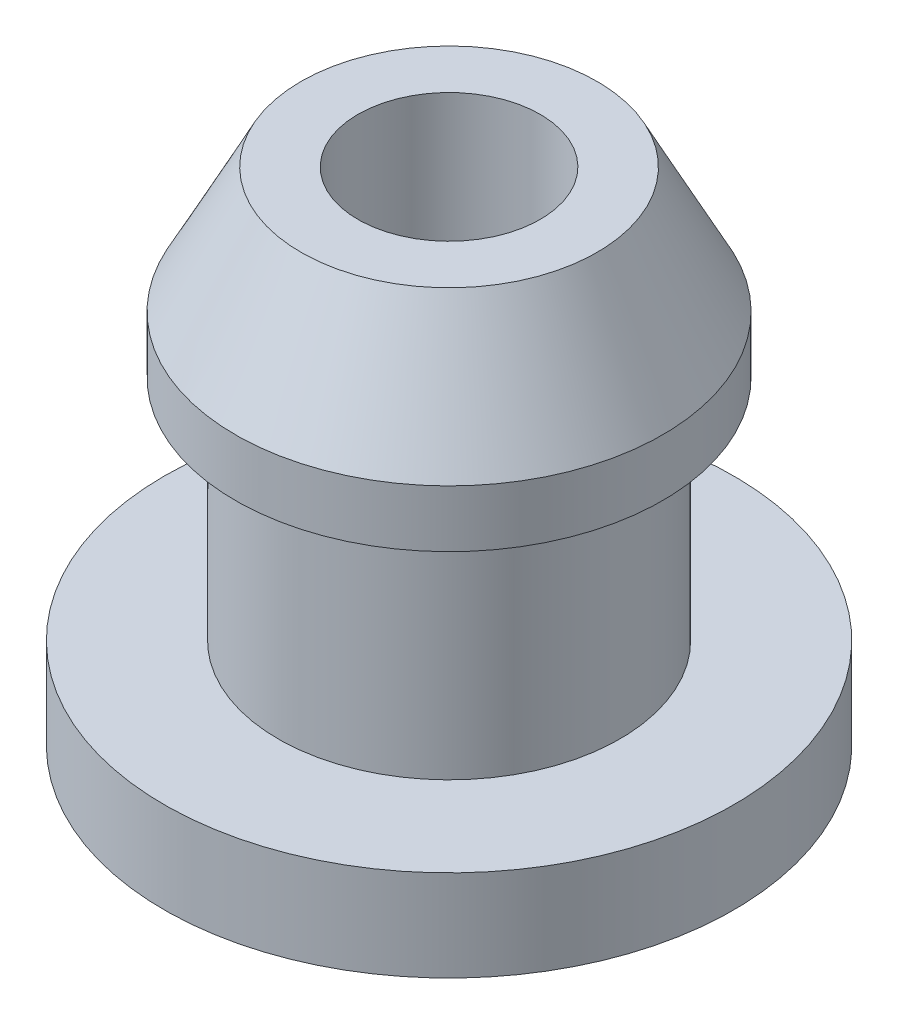
ISO-10303-21;
HEADER;
FILE_DESCRIPTION(('STEP AP214'),'2;1');
FILE_NAME('part.step','',(''),(''),'','','');
FILE_SCHEMA(('AUTOMOTIVE_DESIGN { 1 0 10303 214 1 1 1 1 }'));
ENDSEC;
DATA;
#1=APPLICATION_CONTEXT('core data for automotive mechanical design processes');
#2=APPLICATION_PROTOCOL_DEFINITION('international standard','automotive_design',2000,#1);
#3=PRODUCT_CONTEXT('',#1,'mechanical');
#4=PRODUCT('Part','Part','',(#3));
#5=PRODUCT_RELATED_PRODUCT_CATEGORY('part','',(#4));
#6=PRODUCT_DEFINITION_FORMATION('','',#4);
#7=PRODUCT_DEFINITION_CONTEXT('part definition',#1,'design');
#8=PRODUCT_DEFINITION('design','',#6,#7);
#9=PRODUCT_DEFINITION_SHAPE('','',#8);
#10=(LENGTH_UNIT() NAMED_UNIT(*) SI_UNIT(.MILLI.,.METRE.));
#11=(NAMED_UNIT(*) PLANE_ANGLE_UNIT() SI_UNIT($,.RADIAN.));
#12=(NAMED_UNIT(*) SI_UNIT($,.STERADIAN.) SOLID_ANGLE_UNIT());
#13=UNCERTAINTY_MEASURE_WITH_UNIT(LENGTH_MEASURE(1.E-05),#10,'distance_accuracy_value','');
#14=(GEOMETRIC_REPRESENTATION_CONTEXT(3) GLOBAL_UNCERTAINTY_ASSIGNED_CONTEXT((#13)) GLOBAL_UNIT_ASSIGNED_CONTEXT((#10,
#11,#12)) REPRESENTATION_CONTEXT('',''));
#15=CARTESIAN_POINT('',(0.,0.,0.));
#16=DIRECTION('',(0.,0.,1.));
#17=DIRECTION('',(1.,0.,0.));
#18=AXIS2_PLACEMENT_3D('',#15,#16,#17);
#19=CARTESIAN_POINT('',(0.,-4.4,0.));
#20=DIRECTION('',(0.,1.,0.));
#21=DIRECTION('',(-1.,0.,0.));
#22=AXIS2_PLACEMENT_3D('',#19,#20,#21);
#23=PLANE('',#22);
#24=CARTESIAN_POINT('',(0.,-4.4,0.));
#25=DIRECTION('',(0.,1.,0.));
#26=DIRECTION('',(-1.,0.,0.));
#27=AXIS2_PLACEMENT_3D('',#24,#25,#26);
#28=CIRCLE('',#27,5.);
#29=CARTESIAN_POINT('',(-5.,-4.4,0.));
#30=VERTEX_POINT('',#29);
#31=EDGE_CURVE('E10',#30,#30,#28,.T.);
#32=ORIENTED_EDGE('',*,*,#31,.F.);
#33=EDGE_LOOP('',(#32));
#34=FACE_BOUND('',#33,.T.);
#35=ADVANCED_FACE('F35',(#34),#23,.F.);
#36=CARTESIAN_POINT('',(0.,5.28,0.));
#37=DIRECTION('',(0.,1.,0.));
#38=DIRECTION('',(-1.,0.,0.));
#39=AXIS2_PLACEMENT_3D('',#36,#37,#38);
#40=CYLINDRICAL_SURFACE('',#39,5.);
#41=CARTESIAN_POINT('',(0.,-2.8,0.));
#42=DIRECTION('',(0.,1.,0.));
#43=DIRECTION('',(-1.,0.,0.));
#44=AXIS2_PLACEMENT_3D('',#41,#42,#43);
#45=CIRCLE('',#44,5.);
#46=CARTESIAN_POINT('',(-5.,-2.8,0.));
#47=VERTEX_POINT('',#46);
#48=EDGE_CURVE('E41',#47,#47,#45,.T.);
#49=ORIENTED_EDGE('',*,*,#48,.F.);
#50=EDGE_LOOP('',(#49));
#51=FACE_BOUND('',#50,.T.);
#52=ORIENTED_EDGE('',*,*,#31,.T.);
#53=EDGE_LOOP('',(#52));
#54=FACE_BOUND('',#53,.T.);
#55=ADVANCED_FACE('F110',(#51,#54),#40,.T.);
#56=CARTESIAN_POINT('',(5.,-2.8,0.));
#57=DIRECTION('',(0.,-1.,0.));
#58=DIRECTION('',(1.,0.,0.));
#59=AXIS2_PLACEMENT_3D('',#56,#57,#58);
#60=PLANE('',#59);
#61=CARTESIAN_POINT('',(0.,-2.8,0.));
#62=DIRECTION('',(0.,1.,0.));
#63=DIRECTION('',(-1.,0.,0.));
#64=AXIS2_PLACEMENT_3D('',#61,#62,#63);
#65=CIRCLE('',#64,3.);
#66=CARTESIAN_POINT('',(-3.,-2.8,0.));
#67=VERTEX_POINT('',#66);
#68=EDGE_CURVE('E45',#67,#67,#65,.T.);
#69=ORIENTED_EDGE('',*,*,#68,.F.);
#70=EDGE_LOOP('',(#69));
#71=FACE_BOUND('',#70,.T.);
#72=ORIENTED_EDGE('',*,*,#48,.T.);
#73=EDGE_LOOP('',(#72));
#74=FACE_BOUND('',#73,.T.);
#75=ADVANCED_FACE('F105',(#71,#74),#60,.F.);
#76=CARTESIAN_POINT('',(0.,5.28,0.));
#77=DIRECTION('',(0.,1.,0.));
#78=DIRECTION('',(-1.,0.,0.));
#79=AXIS2_PLACEMENT_3D('',#76,#77,#78);
#80=CYLINDRICAL_SURFACE('',#79,3.);
#81=CARTESIAN_POINT('',(0.,1.2,0.));
#82=DIRECTION('',(0.,1.,0.));
#83=DIRECTION('',(-1.,0.,0.));
#84=AXIS2_PLACEMENT_3D('',#81,#82,#83);
#85=CIRCLE('',#84,3.);
#86=CARTESIAN_POINT('',(-3.,1.2,0.));
#87=VERTEX_POINT('',#86);
#88=EDGE_CURVE('E49',#87,#87,#85,.T.);
#89=ORIENTED_EDGE('',*,*,#88,.F.);
#90=EDGE_LOOP('',(#89));
#91=FACE_BOUND('',#90,.T.);
#92=ORIENTED_EDGE('',*,*,#68,.T.);
#93=EDGE_LOOP('',(#92));
#94=FACE_BOUND('',#93,.T.);
#95=ADVANCED_FACE('F99',(#91,#94),#80,.T.);
#96=CARTESIAN_POINT('',(3.,1.2,0.));
#97=DIRECTION('',(0.,1.,0.));
#98=DIRECTION('',(-1.,0.,0.));
#99=AXIS2_PLACEMENT_3D('',#96,#97,#98);
#100=PLANE('',#99);
#101=CARTESIAN_POINT('',(0.,1.2,0.));
#102=DIRECTION('',(0.,1.,0.));
#103=DIRECTION('',(-1.,0.,0.));
#104=AXIS2_PLACEMENT_3D('',#101,#102,#103);
#105=CIRCLE('',#104,3.75);
#106=CARTESIAN_POINT('',(-3.75,1.2,0.));
#107=VERTEX_POINT('',#106);
#108=EDGE_CURVE('E54',#107,#107,#105,.T.);
#109=ORIENTED_EDGE('',*,*,#108,.F.);
#110=EDGE_LOOP('',(#109));
#111=FACE_BOUND('',#110,.T.);
#112=ORIENTED_EDGE('',*,*,#88,.T.);
#113=EDGE_LOOP('',(#112));
#114=FACE_BOUND('',#113,.T.);
#115=ADVANCED_FACE('F93',(#111,#114),#100,.F.);
#116=CARTESIAN_POINT('',(0.,5.28,0.));
#117=DIRECTION('',(0.,1.,0.));
#118=DIRECTION('',(-1.,0.,0.));
#119=AXIS2_PLACEMENT_3D('',#116,#117,#118);
#120=CYLINDRICAL_SURFACE('',#119,3.75);
#121=CARTESIAN_POINT('',(0.,2.2,0.));
#122=DIRECTION('',(0.,1.,0.));
#123=DIRECTION('',(-1.,0.,0.));
#124=AXIS2_PLACEMENT_3D('',#121,#122,#123);
#125=CIRCLE('',#124,3.75);
#126=CARTESIAN_POINT('',(-3.75,2.2,0.));
#127=VERTEX_POINT('',#126);
#128=EDGE_CURVE('E57',#127,#127,#125,.T.);
#129=ORIENTED_EDGE('',*,*,#128,.F.);
#130=EDGE_LOOP('',(#129));
#131=FACE_BOUND('',#130,.T.);
#132=ORIENTED_EDGE('',*,*,#108,.T.);
#133=EDGE_LOOP('',(#132));
#134=FACE_BOUND('',#133,.T.);
#135=ADVANCED_FACE('F87',(#131,#134),#120,.T.);
#136=CARTESIAN_POINT('',(0.,2.2,0.));
#137=DIRECTION('',(0.,-1.,0.));
#138=DIRECTION('',(1.,0.,0.));
#139=AXIS2_PLACEMENT_3D('',#136,#137,#138);
#140=CONICAL_SURFACE('',#139,3.75,0.481663677554861);
#141=CARTESIAN_POINT('',(0.,4.4,0.));
#142=DIRECTION('',(0.,1.,0.));
#143=DIRECTION('',(-1.,0.,0.));
#144=AXIS2_PLACEMENT_3D('',#141,#142,#143);
#145=CIRCLE('',#144,2.6);
#146=CARTESIAN_POINT('',(-2.6,4.4,0.));
#147=VERTEX_POINT('',#146);
#148=EDGE_CURVE('E60',#147,#147,#145,.T.);
#149=ORIENTED_EDGE('',*,*,#148,.F.);
#150=EDGE_LOOP('',(#149));
#151=FACE_BOUND('',#150,.T.);
#152=ORIENTED_EDGE('',*,*,#128,.T.);
#153=EDGE_LOOP('',(#152));
#154=FACE_BOUND('',#153,.T.);
#155=ADVANCED_FACE('F81',(#151,#154),#140,.T.);
#156=CARTESIAN_POINT('',(1.6,4.4,0.));
#157=DIRECTION('',(0.,-1.,0.));
#158=DIRECTION('',(1.,0.,0.));
#159=AXIS2_PLACEMENT_3D('',#156,#157,#158);
#160=PLANE('',#159);
#161=CARTESIAN_POINT('',(0.,4.4,0.));
#162=DIRECTION('',(0.,1.,0.));
#163=DIRECTION('',(-1.,0.,0.));
#164=AXIS2_PLACEMENT_3D('',#161,#162,#163);
#165=CIRCLE('',#164,1.6);
#166=CARTESIAN_POINT('',(-1.6,4.4,0.));
#167=VERTEX_POINT('',#166);
#168=EDGE_CURVE('E63',#167,#167,#165,.T.);
#169=ORIENTED_EDGE('',*,*,#168,.F.);
#170=EDGE_LOOP('',(#169));
#171=FACE_BOUND('',#170,.T.);
#172=ORIENTED_EDGE('',*,*,#148,.T.);
#173=EDGE_LOOP('',(#172));
#174=FACE_BOUND('',#173,.T.);
#175=ADVANCED_FACE('F75',(#171,#174),#160,.F.);
#176=CARTESIAN_POINT('',(0.,5.28,0.));
#177=DIRECTION('',(0.,1.,0.));
#178=DIRECTION('',(-1.,0.,0.));
#179=AXIS2_PLACEMENT_3D('',#176,#177,#178);
#180=CYLINDRICAL_SURFACE('',#179,1.6);
#181=CARTESIAN_POINT('',(0.,-1.6,0.));
#182=DIRECTION('',(0.,1.,0.));
#183=DIRECTION('',(-1.,0.,0.));
#184=AXIS2_PLACEMENT_3D('',#181,#182,#183);
#185=CIRCLE('',#184,1.6);
#186=CARTESIAN_POINT('',(-1.6,-1.6,0.));
#187=VERTEX_POINT('',#186);
#188=EDGE_CURVE('E66',#187,#187,#185,.T.);
#189=ORIENTED_EDGE('',*,*,#188,.F.);
#190=EDGE_LOOP('',(#189));
#191=FACE_BOUND('',#190,.T.);
#192=ORIENTED_EDGE('',*,*,#168,.T.);
#193=EDGE_LOOP('',(#192));
#194=FACE_BOUND('',#193,.T.);
#195=ADVANCED_FACE('F72',(#191,#194),#180,.F.);
#196=CARTESIAN_POINT('',(0.,-1.6,0.));
#197=DIRECTION('',(0.,-1.,0.));
#198=DIRECTION('',(1.,0.,0.));
#199=AXIS2_PLACEMENT_3D('',#196,#197,#198);
#200=PLANE('',#199);
#201=ORIENTED_EDGE('',*,*,#188,.T.);
#202=EDGE_LOOP('',(#201));
#203=FACE_BOUND('',#202,.T.);
#204=ADVANCED_FACE('F70',(#203),#200,.F.);
#205=CLOSED_SHELL('',(#35,#55,#75,#95,#115,#135,#155,#175,#195,#204));
#206=MANIFOLD_SOLID_BREP('B2',#205);
#207=ADVANCED_BREP_SHAPE_REPRESENTATION('',(#18,#206),#14);
#208=SHAPE_DEFINITION_REPRESENTATION(#9,#207);
ENDSEC;
END-ISO-10303-21;
